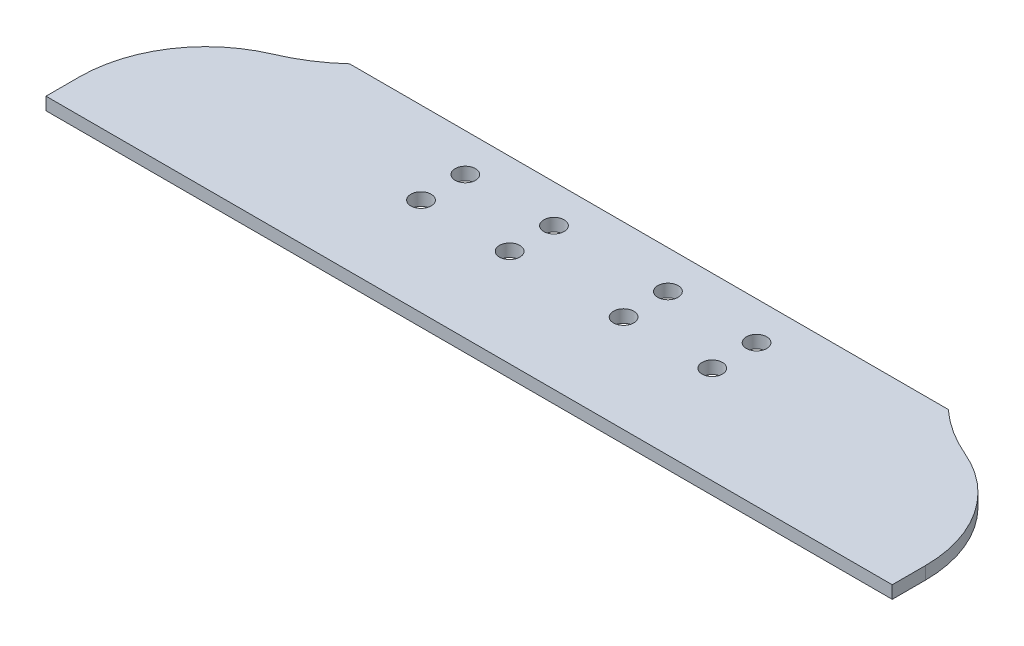
ISO-10303-21;
HEADER;
FILE_DESCRIPTION(('STEP AP214'),'2;1');
FILE_NAME('part.step','',(''),(''),'','','');
FILE_SCHEMA(('AUTOMOTIVE_DESIGN { 1 0 10303 214 1 1 1 1 }'));
ENDSEC;
DATA;
#1=APPLICATION_CONTEXT('core data for automotive mechanical design processes');
#2=APPLICATION_PROTOCOL_DEFINITION('international standard','automotive_design',2000,#1);
#3=PRODUCT_CONTEXT('',#1,'mechanical');
#4=PRODUCT('Part','Part','',(#3));
#5=PRODUCT_RELATED_PRODUCT_CATEGORY('part','',(#4));
#6=PRODUCT_DEFINITION_FORMATION('','',#4);
#7=PRODUCT_DEFINITION_CONTEXT('part definition',#1,'design');
#8=PRODUCT_DEFINITION('design','',#6,#7);
#9=PRODUCT_DEFINITION_SHAPE('','',#8);
#10=(LENGTH_UNIT() NAMED_UNIT(*) SI_UNIT(.MILLI.,.METRE.));
#11=(NAMED_UNIT(*) PLANE_ANGLE_UNIT() SI_UNIT($,.RADIAN.));
#12=(NAMED_UNIT(*) SI_UNIT($,.STERADIAN.) SOLID_ANGLE_UNIT());
#13=UNCERTAINTY_MEASURE_WITH_UNIT(LENGTH_MEASURE(1.E-05),#10,'distance_accuracy_value','');
#14=(GEOMETRIC_REPRESENTATION_CONTEXT(3) GLOBAL_UNCERTAINTY_ASSIGNED_CONTEXT((#13)) GLOBAL_UNIT_ASSIGNED_CONTEXT((#10,
#11,#12)) REPRESENTATION_CONTEXT('',''));
#15=CARTESIAN_POINT('',(0.,0.,0.));
#16=DIRECTION('',(0.,0.,1.));
#17=DIRECTION('',(1.,0.,0.));
#18=AXIS2_PLACEMENT_3D('',#15,#16,#17);
#19=CARTESIAN_POINT('',(74.3401280605345,0.,66.8472916113481));
#20=DIRECTION('',(0.,1.,0.));
#21=DIRECTION('',(0.,0.,1.));
#22=AXIS2_PLACEMENT_3D('',#19,#20,#21);
#23=PLANE('',#22);
#24=CARTESIAN_POINT('',(-36.5125,0.,50.751198508164));
#25=DIRECTION('',(0.,1.,0.));
#26=DIRECTION('',(0.,0.,1.));
#27=AXIS2_PLACEMENT_3D('',#24,#25,#26);
#28=CIRCLE('',#27,2.5527);
#29=CARTESIAN_POINT('',(-36.5125,0.,53.303898508164));
#30=VERTEX_POINT('',#29);
#31=EDGE_CURVE('E379',#30,#30,#28,.T.);
#32=ORIENTED_EDGE('',*,*,#31,.F.);
#33=EDGE_LOOP('',(#32));
#34=FACE_BOUND('',#33,.T.);
#35=CARTESIAN_POINT('',(36.5125,0.,39.638698508164));
#36=DIRECTION('',(0.,1.,0.));
#37=DIRECTION('',(0.,0.,1.));
#38=AXIS2_PLACEMENT_3D('',#35,#36,#37);
#39=CIRCLE('',#38,2.5527);
#40=CARTESIAN_POINT('',(36.5125,0.,42.191398508164));
#41=VERTEX_POINT('',#40);
#42=EDGE_CURVE('E380',#41,#41,#39,.T.);
#43=ORIENTED_EDGE('',*,*,#42,.F.);
#44=EDGE_LOOP('',(#43));
#45=FACE_BOUND('',#44,.T.);
#46=CARTESIAN_POINT('',(14.2875,0.,39.638698508164));
#47=DIRECTION('',(0.,1.,0.));
#48=DIRECTION('',(0.,0.,1.));
#49=AXIS2_PLACEMENT_3D('',#46,#47,#48);
#50=CIRCLE('',#49,2.5527);
#51=CARTESIAN_POINT('',(14.2875,0.,42.191398508164));
#52=VERTEX_POINT('',#51);
#53=EDGE_CURVE('E384',#52,#52,#50,.T.);
#54=ORIENTED_EDGE('',*,*,#53,.F.);
#55=EDGE_LOOP('',(#54));
#56=FACE_BOUND('',#55,.T.);
#57=CARTESIAN_POINT('',(-14.2875,0.,39.638698508164));
#58=DIRECTION('',(0.,1.,0.));
#59=DIRECTION('',(0.,0.,1.));
#60=AXIS2_PLACEMENT_3D('',#57,#58,#59);
#61=CIRCLE('',#60,2.5527);
#62=CARTESIAN_POINT('',(-14.2875,0.,42.191398508164));
#63=VERTEX_POINT('',#62);
#64=EDGE_CURVE('E391',#63,#63,#61,.T.);
#65=ORIENTED_EDGE('',*,*,#64,.F.);
#66=EDGE_LOOP('',(#65));
#67=FACE_BOUND('',#66,.T.);
#68=CARTESIAN_POINT('',(-14.2875,0.,50.751198508164));
#69=DIRECTION('',(0.,1.,0.));
#70=DIRECTION('',(0.,0.,1.));
#71=AXIS2_PLACEMENT_3D('',#68,#69,#70);
#72=CIRCLE('',#71,2.5527);
#73=CARTESIAN_POINT('',(-14.2875,0.,53.303898508164));
#74=VERTEX_POINT('',#73);
#75=EDGE_CURVE('E381',#74,#74,#72,.T.);
#76=ORIENTED_EDGE('',*,*,#75,.F.);
#77=EDGE_LOOP('',(#76));
#78=FACE_BOUND('',#77,.T.);
#79=CARTESIAN_POINT('',(14.2875,0.,50.751198508164));
#80=DIRECTION('',(0.,1.,0.));
#81=DIRECTION('',(0.,0.,1.));
#82=AXIS2_PLACEMENT_3D('',#79,#80,#81);
#83=CIRCLE('',#82,2.5527);
#84=CARTESIAN_POINT('',(14.2875,0.,53.303898508164));
#85=VERTEX_POINT('',#84);
#86=EDGE_CURVE('E387',#85,#85,#83,.T.);
#87=ORIENTED_EDGE('',*,*,#86,.F.);
#88=EDGE_LOOP('',(#87));
#89=FACE_BOUND('',#88,.T.);
#90=CARTESIAN_POINT('',(36.5125,0.,50.751198508164));
#91=DIRECTION('',(0.,1.,0.));
#92=DIRECTION('',(0.,0.,1.));
#93=AXIS2_PLACEMENT_3D('',#90,#91,#92);
#94=CIRCLE('',#93,2.5527);
#95=CARTESIAN_POINT('',(36.5125,0.,53.303898508164));
#96=VERTEX_POINT('',#95);
#97=EDGE_CURVE('E408',#96,#96,#94,.T.);
#98=ORIENTED_EDGE('',*,*,#97,.F.);
#99=EDGE_LOOP('',(#98));
#100=FACE_BOUND('',#99,.T.);
#101=CARTESIAN_POINT('',(-36.5125,0.,39.638698508164));
#102=DIRECTION('',(0.,1.,0.));
#103=DIRECTION('',(0.,0.,1.));
#104=AXIS2_PLACEMENT_3D('',#101,#102,#103);
#105=CIRCLE('',#104,2.5527);
#106=CARTESIAN_POINT('',(-36.5125,0.,42.191398508164));
#107=VERTEX_POINT('',#106);
#108=EDGE_CURVE('E162',#107,#107,#105,.T.);
#109=ORIENTED_EDGE('',*,*,#108,.F.);
#110=EDGE_LOOP('',(#109));
#111=FACE_BOUND('',#110,.T.);
#112=DIRECTION('',(-1.,0.,0.));
#113=VECTOR('',#112,1.);
#114=CARTESIAN_POINT('',(22.86,0.,30.113698508164));
#115=LINE('',#114,#113);
#116=CARTESIAN_POINT('',(75.0523471244315,0.,30.113698508164));
#117=VERTEX_POINT('',#116);
#118=CARTESIAN_POINT('',(-75.0523471244315,0.,30.113698508164));
#119=VERTEX_POINT('',#118);
#120=EDGE_CURVE('E114',#117,#119,#115,.T.);
#121=ORIENTED_EDGE('',*,*,#120,.T.);
#122=CARTESIAN_POINT('',(-102.892624920902,0.,-0.388804631468346));
#123=DIRECTION('',(0.,-1.,0.));
#124=DIRECTION('',(0.,0.,1.));
#125=AXIS2_PLACEMENT_3D('',#122,#123,#124);
#126=CIRCLE('',#125,41.2975031396323);
#127=CARTESIAN_POINT('',(-86.7504328122766,0.,37.6232118829993));
#128=VERTEX_POINT('',#127);
#129=EDGE_CURVE('E106',#119,#128,#126,.T.);
#130=ORIENTED_EDGE('',*,*,#129,.T.);
#131=CARTESIAN_POINT('',(-74.3401280605345,0.,66.8472916113481));
#132=DIRECTION('',(0.,1.,0.));
#133=DIRECTION('',(0.,0.,1.));
#134=AXIS2_PLACEMENT_3D('',#131,#132,#133);
#135=CIRCLE('',#134,31.75);
#136=CARTESIAN_POINT('',(-106.090128060535,0.,66.8472916113481));
#137=VERTEX_POINT('',#136);
#138=EDGE_CURVE('E109',#128,#137,#135,.T.);
#139=ORIENTED_EDGE('',*,*,#138,.T.);
#140=DIRECTION('',(0.,0.,1.));
#141=VECTOR('',#140,1.);
#142=CARTESIAN_POINT('',(-106.090128060535,0.,66.8472916113481));
#143=LINE('',#142,#141);
#144=CARTESIAN_POINT('',(-106.090128060535,0.,75.1986985081639));
#145=VERTEX_POINT('',#144);
#146=EDGE_CURVE('E60',#137,#145,#143,.T.);
#147=ORIENTED_EDGE('',*,*,#146,.T.);
#148=DIRECTION('',(1.,0.,0.));
#149=VECTOR('',#148,1.);
#150=CARTESIAN_POINT('',(-106.090128060535,0.,75.1986985081639));
#151=LINE('',#150,#149);
#152=CARTESIAN_POINT('',(106.090128060535,0.,75.1986985081639));
#153=VERTEX_POINT('',#152);
#154=EDGE_CURVE('E149',#145,#153,#151,.T.);
#155=ORIENTED_EDGE('',*,*,#154,.T.);
#156=DIRECTION('',(0.,0.,-1.));
#157=VECTOR('',#156,1.);
#158=CARTESIAN_POINT('',(106.090128060535,0.,75.1986985081639));
#159=LINE('',#158,#157);
#160=CARTESIAN_POINT('',(106.090128060535,0.,66.8472916113481));
#161=VERTEX_POINT('',#160);
#162=EDGE_CURVE('E96',#153,#161,#159,.T.);
#163=ORIENTED_EDGE('',*,*,#162,.T.);
#164=CARTESIAN_POINT('',(74.3401280605345,0.,66.8472916113481));
#165=DIRECTION('',(0.,1.,0.));
#166=DIRECTION('',(0.,0.,1.));
#167=AXIS2_PLACEMENT_3D('',#164,#165,#166);
#168=CIRCLE('',#167,31.75);
#169=CARTESIAN_POINT('',(86.7504328122767,0.,37.6232118829993));
#170=VERTEX_POINT('',#169);
#171=EDGE_CURVE('E193',#161,#170,#168,.T.);
#172=ORIENTED_EDGE('',*,*,#171,.T.);
#173=CARTESIAN_POINT('',(102.892624920902,0.,-0.388804631468346));
#174=DIRECTION('',(0.,-1.,0.));
#175=DIRECTION('',(0.,0.,1.));
#176=AXIS2_PLACEMENT_3D('',#173,#174,#175);
#177=CIRCLE('',#176,41.2975031396323);
#178=EDGE_CURVE('E195',#170,#117,#177,.T.);
#179=ORIENTED_EDGE('',*,*,#178,.T.);
#180=EDGE_LOOP('',(#121,#130,#139,#147,#155,#163,#172,#179));
#181=FACE_BOUND('',#180,.T.);
#182=ADVANCED_FACE('F35',(#34,#45,#56,#67,#78,#89,#100,#111,#181),#23,.T.);
#183=CARTESIAN_POINT('',(74.3401280605345,-3.175,66.8472916113481));
#184=DIRECTION('',(0.,1.,0.));
#185=DIRECTION('',(0.,0.,1.));
#186=AXIS2_PLACEMENT_3D('',#183,#184,#185);
#187=PLANE('',#186);
#188=CARTESIAN_POINT('',(-36.5125,-3.175,50.751198508164));
#189=DIRECTION('',(0.,1.,0.));
#190=DIRECTION('',(0.,0.,1.));
#191=AXIS2_PLACEMENT_3D('',#188,#189,#190);
#192=CIRCLE('',#191,2.5527);
#193=CARTESIAN_POINT('',(-36.5125,-3.175,53.303898508164));
#194=VERTEX_POINT('',#193);
#195=EDGE_CURVE('E39',#194,#194,#192,.T.);
#196=ORIENTED_EDGE('',*,*,#195,.T.);
#197=EDGE_LOOP('',(#196));
#198=FACE_BOUND('',#197,.T.);
#199=CARTESIAN_POINT('',(36.5125,-3.17500000000001,39.638698508164));
#200=DIRECTION('',(0.,1.,0.));
#201=DIRECTION('',(0.,0.,1.));
#202=AXIS2_PLACEMENT_3D('',#199,#200,#201);
#203=CIRCLE('',#202,2.5527);
#204=CARTESIAN_POINT('',(36.5125,-3.17500000000001,42.191398508164));
#205=VERTEX_POINT('',#204);
#206=EDGE_CURVE('E176',#205,#205,#203,.T.);
#207=ORIENTED_EDGE('',*,*,#206,.T.);
#208=EDGE_LOOP('',(#207));
#209=FACE_BOUND('',#208,.T.);
#210=CARTESIAN_POINT('',(14.2875,-3.17500000000001,39.638698508164));
#211=DIRECTION('',(0.,1.,0.));
#212=DIRECTION('',(0.,0.,1.));
#213=AXIS2_PLACEMENT_3D('',#210,#211,#212);
#214=CIRCLE('',#213,2.5527);
#215=CARTESIAN_POINT('',(14.2875,-3.17500000000001,42.191398508164));
#216=VERTEX_POINT('',#215);
#217=EDGE_CURVE('E174',#216,#216,#214,.T.);
#218=ORIENTED_EDGE('',*,*,#217,.T.);
#219=EDGE_LOOP('',(#218));
#220=FACE_BOUND('',#219,.T.);
#221=CARTESIAN_POINT('',(-14.2875,-3.17500000000001,39.638698508164));
#222=DIRECTION('',(0.,1.,0.));
#223=DIRECTION('',(0.,0.,1.));
#224=AXIS2_PLACEMENT_3D('',#221,#222,#223);
#225=CIRCLE('',#224,2.5527);
#226=CARTESIAN_POINT('',(-14.2875,-3.17500000000001,42.191398508164));
#227=VERTEX_POINT('',#226);
#228=EDGE_CURVE('E171',#227,#227,#225,.T.);
#229=ORIENTED_EDGE('',*,*,#228,.T.);
#230=EDGE_LOOP('',(#229));
#231=FACE_BOUND('',#230,.T.);
#232=CARTESIAN_POINT('',(-14.2875,-3.175,50.751198508164));
#233=DIRECTION('',(0.,1.,0.));
#234=DIRECTION('',(0.,0.,1.));
#235=AXIS2_PLACEMENT_3D('',#232,#233,#234);
#236=CIRCLE('',#235,2.5527);
#237=CARTESIAN_POINT('',(-14.2875,-3.175,53.303898508164));
#238=VERTEX_POINT('',#237);
#239=EDGE_CURVE('E168',#238,#238,#236,.T.);
#240=ORIENTED_EDGE('',*,*,#239,.T.);
#241=EDGE_LOOP('',(#240));
#242=FACE_BOUND('',#241,.T.);
#243=CARTESIAN_POINT('',(14.2875,-3.175,50.751198508164));
#244=DIRECTION('',(0.,1.,0.));
#245=DIRECTION('',(0.,0.,1.));
#246=AXIS2_PLACEMENT_3D('',#243,#244,#245);
#247=CIRCLE('',#246,2.5527);
#248=CARTESIAN_POINT('',(14.2875,-3.175,53.303898508164));
#249=VERTEX_POINT('',#248);
#250=EDGE_CURVE('E165',#249,#249,#247,.T.);
#251=ORIENTED_EDGE('',*,*,#250,.T.);
#252=EDGE_LOOP('',(#251));
#253=FACE_BOUND('',#252,.T.);
#254=CARTESIAN_POINT('',(36.5125,-3.175,50.751198508164));
#255=DIRECTION('',(0.,1.,0.));
#256=DIRECTION('',(0.,0.,1.));
#257=AXIS2_PLACEMENT_3D('',#254,#255,#256);
#258=CIRCLE('',#257,2.5527);
#259=CARTESIAN_POINT('',(36.5125,-3.175,53.303898508164));
#260=VERTEX_POINT('',#259);
#261=EDGE_CURVE('E161',#260,#260,#258,.T.);
#262=ORIENTED_EDGE('',*,*,#261,.T.);
#263=EDGE_LOOP('',(#262));
#264=FACE_BOUND('',#263,.T.);
#265=CARTESIAN_POINT('',(-36.5125,-3.17500000000001,39.638698508164));
#266=DIRECTION('',(0.,1.,0.));
#267=DIRECTION('',(0.,0.,1.));
#268=AXIS2_PLACEMENT_3D('',#265,#266,#267);
#269=CIRCLE('',#268,2.5527);
#270=CARTESIAN_POINT('',(-36.5125,-3.17500000000001,42.191398508164));
#271=VERTEX_POINT('',#270);
#272=EDGE_CURVE('E158',#271,#271,#269,.T.);
#273=ORIENTED_EDGE('',*,*,#272,.T.);
#274=EDGE_LOOP('',(#273));
#275=FACE_BOUND('',#274,.T.);
#276=CARTESIAN_POINT('',(-102.892624920902,-3.175,-0.388804631468349));
#277=DIRECTION('',(0.,-1.,0.));
#278=DIRECTION('',(0.,0.,1.));
#279=AXIS2_PLACEMENT_3D('',#276,#277,#278);
#280=CIRCLE('',#279,41.2975031396323);
#281=CARTESIAN_POINT('',(-75.0523471244315,-3.175,30.113698508164));
#282=VERTEX_POINT('',#281);
#283=CARTESIAN_POINT('',(-86.7504328122766,-3.17500000000001,37.6232118829993));
#284=VERTEX_POINT('',#283);
#285=EDGE_CURVE('E121',#282,#284,#280,.T.);
#286=ORIENTED_EDGE('',*,*,#285,.F.);
#287=DIRECTION('',(-1.,0.,0.));
#288=VECTOR('',#287,1.);
#289=CARTESIAN_POINT('',(22.86,-3.175,30.113698508164));
#290=LINE('',#289,#288);
#291=CARTESIAN_POINT('',(75.0523471244315,-3.175,30.113698508164));
#292=VERTEX_POINT('',#291);
#293=EDGE_CURVE('E52',#292,#282,#290,.T.);
#294=ORIENTED_EDGE('',*,*,#293,.F.);
#295=CARTESIAN_POINT('',(102.892624920902,-3.175,-0.388804631468349));
#296=DIRECTION('',(0.,-1.,0.));
#297=DIRECTION('',(0.,0.,1.));
#298=AXIS2_PLACEMENT_3D('',#295,#296,#297);
#299=CIRCLE('',#298,41.2975031396323);
#300=CARTESIAN_POINT('',(86.7504328122767,-3.175,37.6232118829993));
#301=VERTEX_POINT('',#300);
#302=EDGE_CURVE('E141',#301,#292,#299,.T.);
#303=ORIENTED_EDGE('',*,*,#302,.F.);
#304=CARTESIAN_POINT('',(74.3401280605345,-3.175,66.8472916113481));
#305=DIRECTION('',(0.,1.,0.));
#306=DIRECTION('',(0.,0.,1.));
#307=AXIS2_PLACEMENT_3D('',#304,#305,#306);
#308=CIRCLE('',#307,31.75);
#309=CARTESIAN_POINT('',(106.090128060535,-3.175,66.8472916113481));
#310=VERTEX_POINT('',#309);
#311=EDGE_CURVE('E139',#310,#301,#308,.T.);
#312=ORIENTED_EDGE('',*,*,#311,.F.);
#313=DIRECTION('',(0.,0.,-1.));
#314=VECTOR('',#313,1.);
#315=CARTESIAN_POINT('',(106.090128060535,-3.175,75.1986985081639));
#316=LINE('',#315,#314);
#317=CARTESIAN_POINT('',(106.090128060535,-3.175,75.1986985081639));
#318=VERTEX_POINT('',#317);
#319=EDGE_CURVE('E136',#318,#310,#316,.T.);
#320=ORIENTED_EDGE('',*,*,#319,.F.);
#321=DIRECTION('',(1.,0.,0.));
#322=VECTOR('',#321,1.);
#323=CARTESIAN_POINT('',(-106.090128060535,-3.17500000000001,75.1986985081639));
#324=LINE('',#323,#322);
#325=CARTESIAN_POINT('',(-106.090128060535,-3.17500000000001,75.1986985081639));
#326=VERTEX_POINT('',#325);
#327=EDGE_CURVE('E133',#326,#318,#324,.T.);
#328=ORIENTED_EDGE('',*,*,#327,.F.);
#329=DIRECTION('',(0.,0.,1.));
#330=VECTOR('',#329,1.);
#331=CARTESIAN_POINT('',(-106.090128060535,-3.175,66.8472916113481));
#332=LINE('',#331,#330);
#333=CARTESIAN_POINT('',(-106.090128060535,-3.175,66.8472916113481));
#334=VERTEX_POINT('',#333);
#335=EDGE_CURVE('E87',#334,#326,#332,.T.);
#336=ORIENTED_EDGE('',*,*,#335,.F.);
#337=CARTESIAN_POINT('',(-74.3401280605345,-3.175,66.8472916113481));
#338=DIRECTION('',(0.,1.,0.));
#339=DIRECTION('',(0.,0.,1.));
#340=AXIS2_PLACEMENT_3D('',#337,#338,#339);
#341=CIRCLE('',#340,31.75);
#342=EDGE_CURVE('E146',#284,#334,#341,.T.);
#343=ORIENTED_EDGE('',*,*,#342,.F.);
#344=EDGE_LOOP('',(#286,#294,#303,#312,#320,#328,#336,#343));
#345=FACE_BOUND('',#344,.T.);
#346=ADVANCED_FACE('F203',(#198,#209,#220,#231,#242,#253,#264,#275,#345),#187,.F.);
#347=CARTESIAN_POINT('',(-106.090128060535,0.,75.1986985081639));
#348=DIRECTION('',(0.,0.,-1.));
#349=DIRECTION('',(0.,1.,0.));
#350=AXIS2_PLACEMENT_3D('',#347,#348,#349);
#351=PLANE('',#350);
#352=ORIENTED_EDGE('',*,*,#327,.T.);
#353=DIRECTION('',(0.,-1.,0.));
#354=VECTOR('',#353,1.);
#355=CARTESIAN_POINT('',(106.090128060535,0.,75.1986985081639));
#356=LINE('',#355,#354);
#357=EDGE_CURVE('E44',#153,#318,#356,.T.);
#358=ORIENTED_EDGE('',*,*,#357,.F.);
#359=ORIENTED_EDGE('',*,*,#154,.F.);
#360=DIRECTION('',(0.,-1.,0.));
#361=VECTOR('',#360,1.);
#362=CARTESIAN_POINT('',(-106.090128060535,0.,75.1986985081639));
#363=LINE('',#362,#361);
#364=EDGE_CURVE('E129',#145,#326,#363,.T.);
#365=ORIENTED_EDGE('',*,*,#364,.T.);
#366=EDGE_LOOP('',(#352,#358,#359,#365));
#367=FACE_BOUND('',#366,.T.);
#368=ADVANCED_FACE('F37',(#367),#351,.F.);
#369=CARTESIAN_POINT('',(106.090128060535,0.,75.1986985081639));
#370=DIRECTION('',(-1.,0.,0.));
#371=DIRECTION('',(0.,0.707106781186544,0.707106781186552));
#372=AXIS2_PLACEMENT_3D('',#369,#370,#371);
#373=PLANE('',#372);
#374=ORIENTED_EDGE('',*,*,#319,.T.);
#375=DIRECTION('',(0.,-1.,0.));
#376=VECTOR('',#375,1.);
#377=CARTESIAN_POINT('',(106.090128060535,0.,66.8472916113481));
#378=LINE('',#377,#376);
#379=EDGE_CURVE('E154',#161,#310,#378,.T.);
#380=ORIENTED_EDGE('',*,*,#379,.F.);
#381=ORIENTED_EDGE('',*,*,#162,.F.);
#382=ORIENTED_EDGE('',*,*,#357,.T.);
#383=EDGE_LOOP('',(#374,#380,#381,#382));
#384=FACE_BOUND('',#383,.T.);
#385=ADVANCED_FACE('F345',(#384),#373,.F.);
#386=CARTESIAN_POINT('',(74.3401280605345,0.,66.8472916113481));
#387=DIRECTION('',(0.,-1.,0.));
#388=DIRECTION('',(0.,0.,-1.));
#389=AXIS2_PLACEMENT_3D('',#386,#387,#388);
#390=CYLINDRICAL_SURFACE('',#389,31.75);
#391=ORIENTED_EDGE('',*,*,#311,.T.);
#392=DIRECTION('',(0.,-1.,0.));
#393=VECTOR('',#392,1.);
#394=CARTESIAN_POINT('',(86.7504328122767,0.,37.6232118829993));
#395=LINE('',#394,#393);
#396=EDGE_CURVE('E124',#170,#301,#395,.T.);
#397=ORIENTED_EDGE('',*,*,#396,.F.);
#398=ORIENTED_EDGE('',*,*,#171,.F.);
#399=ORIENTED_EDGE('',*,*,#379,.T.);
#400=EDGE_LOOP('',(#391,#397,#398,#399));
#401=FACE_BOUND('',#400,.T.);
#402=ADVANCED_FACE('F213',(#401),#390,.T.);
#403=CARTESIAN_POINT('',(102.892624920902,0.,-0.388804631468346));
#404=DIRECTION('',(0.,-1.,0.));
#405=DIRECTION('',(0.,0.,-1.));
#406=AXIS2_PLACEMENT_3D('',#403,#404,#405);
#407=CYLINDRICAL_SURFACE('',#406,41.2975031396323);
#408=ORIENTED_EDGE('',*,*,#302,.T.);
#409=DIRECTION('',(0.,1.,0.));
#410=VECTOR('',#409,1.);
#411=CARTESIAN_POINT('',(75.0523471244315,-83.3397410593548,30.1136985081639));
#412=LINE('',#411,#410);
#413=EDGE_CURVE('E137',#292,#117,#412,.T.);
#414=ORIENTED_EDGE('',*,*,#413,.T.);
#415=ORIENTED_EDGE('',*,*,#178,.F.);
#416=ORIENTED_EDGE('',*,*,#396,.T.);
#417=EDGE_LOOP('',(#408,#414,#415,#416));
#418=FACE_BOUND('',#417,.T.);
#419=ADVANCED_FACE('F198',(#418),#407,.F.);
#420=CARTESIAN_POINT('',(22.86,0.,30.113698508164));
#421=DIRECTION('',(0.,0.,1.));
#422=DIRECTION('',(0.,-1.,0.));
#423=AXIS2_PLACEMENT_3D('',#420,#421,#422);
#424=PLANE('',#423);
#425=ORIENTED_EDGE('',*,*,#293,.T.);
#426=DIRECTION('',(0.,-1.,0.));
#427=VECTOR('',#426,1.);
#428=CARTESIAN_POINT('',(-75.0523471244315,0.,30.113698508164));
#429=LINE('',#428,#427);
#430=EDGE_CURVE('E11',#119,#282,#429,.T.);
#431=ORIENTED_EDGE('',*,*,#430,.F.);
#432=ORIENTED_EDGE('',*,*,#120,.F.);
#433=ORIENTED_EDGE('',*,*,#413,.F.);
#434=EDGE_LOOP('',(#425,#431,#432,#433));
#435=FACE_BOUND('',#434,.T.);
#436=ADVANCED_FACE('F204',(#435),#424,.F.);
#437=CARTESIAN_POINT('',(-102.892624920902,0.,-0.388804631468346));
#438=DIRECTION('',(0.,-1.,0.));
#439=DIRECTION('',(0.,0.,-1.));
#440=AXIS2_PLACEMENT_3D('',#437,#438,#439);
#441=CYLINDRICAL_SURFACE('',#440,41.2975031396323);
#442=ORIENTED_EDGE('',*,*,#129,.F.);
#443=ORIENTED_EDGE('',*,*,#430,.T.);
#444=ORIENTED_EDGE('',*,*,#285,.T.);
#445=DIRECTION('',(0.,-1.,0.));
#446=VECTOR('',#445,1.);
#447=CARTESIAN_POINT('',(-86.7504328122766,0.,37.6232118829993));
#448=LINE('',#447,#446);
#449=EDGE_CURVE('E118',#128,#284,#448,.T.);
#450=ORIENTED_EDGE('',*,*,#449,.F.);
#451=EDGE_LOOP('',(#442,#443,#444,#450));
#452=FACE_BOUND('',#451,.T.);
#453=ADVANCED_FACE('F119',(#452),#441,.F.);
#454=CARTESIAN_POINT('',(-74.3401280605345,0.,66.8472916113481));
#455=DIRECTION('',(0.,-1.,0.));
#456=DIRECTION('',(0.,0.,-1.));
#457=AXIS2_PLACEMENT_3D('',#454,#455,#456);
#458=CYLINDRICAL_SURFACE('',#457,31.75);
#459=ORIENTED_EDGE('',*,*,#342,.T.);
#460=DIRECTION('',(0.,-1.,0.));
#461=VECTOR('',#460,1.);
#462=CARTESIAN_POINT('',(-106.090128060535,0.,66.8472916113481));
#463=LINE('',#462,#461);
#464=EDGE_CURVE('E125',#137,#334,#463,.T.);
#465=ORIENTED_EDGE('',*,*,#464,.F.);
#466=ORIENTED_EDGE('',*,*,#138,.F.);
#467=ORIENTED_EDGE('',*,*,#449,.T.);
#468=EDGE_LOOP('',(#459,#465,#466,#467));
#469=FACE_BOUND('',#468,.T.);
#470=ADVANCED_FACE('F127',(#469),#458,.T.);
#471=CARTESIAN_POINT('',(-106.090128060535,0.,66.8472916113481));
#472=DIRECTION('',(1.,0.,0.));
#473=DIRECTION('',(0.,-0.707106781186544,-0.707106781186552));
#474=AXIS2_PLACEMENT_3D('',#471,#472,#473);
#475=PLANE('',#474);
#476=ORIENTED_EDGE('',*,*,#335,.T.);
#477=ORIENTED_EDGE('',*,*,#364,.F.);
#478=ORIENTED_EDGE('',*,*,#146,.F.);
#479=ORIENTED_EDGE('',*,*,#464,.T.);
#480=EDGE_LOOP('',(#476,#477,#478,#479));
#481=FACE_BOUND('',#480,.T.);
#482=ADVANCED_FACE('F228',(#481),#475,.F.);
#483=CARTESIAN_POINT('',(-36.5125,-83.3397410593548,39.638698508164));
#484=DIRECTION('',(0.,1.,0.));
#485=DIRECTION('',(0.,0.,1.));
#486=AXIS2_PLACEMENT_3D('',#483,#484,#485);
#487=CYLINDRICAL_SURFACE('',#486,2.5527);
#488=ORIENTED_EDGE('',*,*,#108,.T.);
#489=EDGE_LOOP('',(#488));
#490=FACE_BOUND('',#489,.T.);
#491=ORIENTED_EDGE('',*,*,#272,.F.);
#492=EDGE_LOOP('',(#491));
#493=FACE_BOUND('',#492,.T.);
#494=ADVANCED_FACE('F225',(#490,#493),#487,.F.);
#495=CARTESIAN_POINT('',(36.5125,-83.3397410593548,50.751198508164));
#496=DIRECTION('',(0.,1.,0.));
#497=DIRECTION('',(0.,0.,1.));
#498=AXIS2_PLACEMENT_3D('',#495,#496,#497);
#499=CYLINDRICAL_SURFACE('',#498,2.5527);
#500=ORIENTED_EDGE('',*,*,#97,.T.);
#501=EDGE_LOOP('',(#500));
#502=FACE_BOUND('',#501,.T.);
#503=ORIENTED_EDGE('',*,*,#261,.F.);
#504=EDGE_LOOP('',(#503));
#505=FACE_BOUND('',#504,.T.);
#506=ADVANCED_FACE('F246',(#502,#505),#499,.F.);
#507=CARTESIAN_POINT('',(14.2875,-83.3397410593548,50.751198508164));
#508=DIRECTION('',(0.,1.,0.));
#509=DIRECTION('',(0.,0.,1.));
#510=AXIS2_PLACEMENT_3D('',#507,#508,#509);
#511=CYLINDRICAL_SURFACE('',#510,2.5527);
#512=ORIENTED_EDGE('',*,*,#86,.T.);
#513=EDGE_LOOP('',(#512));
#514=FACE_BOUND('',#513,.T.);
#515=ORIENTED_EDGE('',*,*,#250,.F.);
#516=EDGE_LOOP('',(#515));
#517=FACE_BOUND('',#516,.T.);
#518=ADVANCED_FACE('F253',(#514,#517),#511,.F.);
#519=CARTESIAN_POINT('',(-14.2875,-83.3397410593548,50.751198508164));
#520=DIRECTION('',(0.,1.,0.));
#521=DIRECTION('',(0.,0.,1.));
#522=AXIS2_PLACEMENT_3D('',#519,#520,#521);
#523=CYLINDRICAL_SURFACE('',#522,2.5527);
#524=ORIENTED_EDGE('',*,*,#75,.T.);
#525=EDGE_LOOP('',(#524));
#526=FACE_BOUND('',#525,.T.);
#527=ORIENTED_EDGE('',*,*,#239,.F.);
#528=EDGE_LOOP('',(#527));
#529=FACE_BOUND('',#528,.T.);
#530=ADVANCED_FACE('F261',(#526,#529),#523,.F.);
#531=CARTESIAN_POINT('',(-14.2875,-83.3397410593548,39.638698508164));
#532=DIRECTION('',(0.,1.,0.));
#533=DIRECTION('',(0.,0.,1.));
#534=AXIS2_PLACEMENT_3D('',#531,#532,#533);
#535=CYLINDRICAL_SURFACE('',#534,2.5527);
#536=ORIENTED_EDGE('',*,*,#64,.T.);
#537=EDGE_LOOP('',(#536));
#538=FACE_BOUND('',#537,.T.);
#539=ORIENTED_EDGE('',*,*,#228,.F.);
#540=EDGE_LOOP('',(#539));
#541=FACE_BOUND('',#540,.T.);
#542=ADVANCED_FACE('F269',(#538,#541),#535,.F.);
#543=CARTESIAN_POINT('',(14.2875,-83.3397410593548,39.638698508164));
#544=DIRECTION('',(0.,1.,0.));
#545=DIRECTION('',(0.,0.,1.));
#546=AXIS2_PLACEMENT_3D('',#543,#544,#545);
#547=CYLINDRICAL_SURFACE('',#546,2.5527);
#548=ORIENTED_EDGE('',*,*,#53,.T.);
#549=EDGE_LOOP('',(#548));
#550=FACE_BOUND('',#549,.T.);
#551=ORIENTED_EDGE('',*,*,#217,.F.);
#552=EDGE_LOOP('',(#551));
#553=FACE_BOUND('',#552,.T.);
#554=ADVANCED_FACE('F277',(#550,#553),#547,.F.);
#555=CARTESIAN_POINT('',(36.5125,-83.3397410593548,39.638698508164));
#556=DIRECTION('',(0.,1.,0.));
#557=DIRECTION('',(0.,0.,1.));
#558=AXIS2_PLACEMENT_3D('',#555,#556,#557);
#559=CYLINDRICAL_SURFACE('',#558,2.5527);
#560=ORIENTED_EDGE('',*,*,#42,.T.);
#561=EDGE_LOOP('',(#560));
#562=FACE_BOUND('',#561,.T.);
#563=ORIENTED_EDGE('',*,*,#206,.F.);
#564=EDGE_LOOP('',(#563));
#565=FACE_BOUND('',#564,.T.);
#566=ADVANCED_FACE('F285',(#562,#565),#559,.F.);
#567=CARTESIAN_POINT('',(-36.5125,-83.3397410593548,50.751198508164));
#568=DIRECTION('',(0.,1.,0.));
#569=DIRECTION('',(0.,0.,1.));
#570=AXIS2_PLACEMENT_3D('',#567,#568,#569);
#571=CYLINDRICAL_SURFACE('',#570,2.5527);
#572=ORIENTED_EDGE('',*,*,#31,.T.);
#573=EDGE_LOOP('',(#572));
#574=FACE_BOUND('',#573,.T.);
#575=ORIENTED_EDGE('',*,*,#195,.F.);
#576=EDGE_LOOP('',(#575));
#577=FACE_BOUND('',#576,.T.);
#578=ADVANCED_FACE('F292',(#574,#577),#571,.F.);
#579=CLOSED_SHELL('',(#182,#346,#368,#385,#402,#419,#436,#453,#470,#482,#494,#506,#518,#530,
#542,#554,#566,#578));
#580=MANIFOLD_SOLID_BREP('B2',#579);
#581=ADVANCED_BREP_SHAPE_REPRESENTATION('',(#18,#580),#14);
#582=SHAPE_DEFINITION_REPRESENTATION(#9,#581);
ENDSEC;
END-ISO-10303-21;
